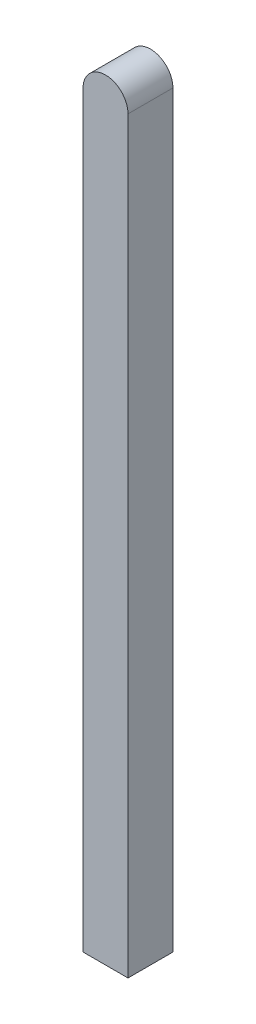
ISO-10303-21;
HEADER;
FILE_DESCRIPTION(('STEP AP214'),'2;1');
FILE_NAME('part.step','',(''),(''),'','','');
FILE_SCHEMA(('AUTOMOTIVE_DESIGN { 1 0 10303 214 1 1 1 1 }'));
ENDSEC;
DATA;
#1=APPLICATION_CONTEXT('core data for automotive mechanical design processes');
#2=APPLICATION_PROTOCOL_DEFINITION('international standard','automotive_design',2000,#1);
#3=PRODUCT_CONTEXT('',#1,'mechanical');
#4=PRODUCT('Part','Part','',(#3));
#5=PRODUCT_RELATED_PRODUCT_CATEGORY('part','',(#4));
#6=PRODUCT_DEFINITION_FORMATION('','',#4);
#7=PRODUCT_DEFINITION_CONTEXT('part definition',#1,'design');
#8=PRODUCT_DEFINITION('design','',#6,#7);
#9=PRODUCT_DEFINITION_SHAPE('','',#8);
#10=(LENGTH_UNIT() NAMED_UNIT(*) SI_UNIT(.MILLI.,.METRE.));
#11=(NAMED_UNIT(*) PLANE_ANGLE_UNIT() SI_UNIT($,.RADIAN.));
#12=(NAMED_UNIT(*) SI_UNIT($,.STERADIAN.) SOLID_ANGLE_UNIT());
#13=UNCERTAINTY_MEASURE_WITH_UNIT(LENGTH_MEASURE(1.E-05),#10,'distance_accuracy_value','');
#14=(GEOMETRIC_REPRESENTATION_CONTEXT(3) GLOBAL_UNCERTAINTY_ASSIGNED_CONTEXT((#13)) GLOBAL_UNIT_ASSIGNED_CONTEXT((#10,
#11,#12)) REPRESENTATION_CONTEXT('',''));
#15=CARTESIAN_POINT('',(0.,0.,0.));
#16=DIRECTION('',(0.,0.,1.));
#17=DIRECTION('',(1.,0.,0.));
#18=AXIS2_PLACEMENT_3D('',#15,#16,#17);
#19=CARTESIAN_POINT('',(15.,500.,-15.));
#20=DIRECTION('',(-1.,0.,0.));
#21=DIRECTION('',(0.,0.,1.));
#22=AXIS2_PLACEMENT_3D('',#19,#20,#21);
#23=PLANE('',#22);
#24=DIRECTION('',(0.,0.,-1.));
#25=VECTOR('',#24,1.);
#26=CARTESIAN_POINT('',(15.,0.,-15.));
#27=LINE('',#26,#25);
#28=CARTESIAN_POINT('',(15.,0.,15.));
#29=VERTEX_POINT('',#28);
#30=CARTESIAN_POINT('',(15.,0.,-15.));
#31=VERTEX_POINT('',#30);
#32=EDGE_CURVE('E101',#29,#31,#27,.T.);
#33=ORIENTED_EDGE('',*,*,#32,.T.);
#34=DIRECTION('',(0.,-1.,0.));
#35=VECTOR('',#34,1.);
#36=CARTESIAN_POINT('',(15.,500.,-15.));
#37=LINE('',#36,#35);
#38=CARTESIAN_POINT('',(15.,500.,-15.));
#39=VERTEX_POINT('',#38);
#40=EDGE_CURVE('E11',#39,#31,#37,.T.);
#41=ORIENTED_EDGE('',*,*,#40,.F.);
#42=DIRECTION('',(0.,0.,-1.));
#43=VECTOR('',#42,1.);
#44=CARTESIAN_POINT('',(15.,500.,-15.));
#45=LINE('',#44,#43);
#46=CARTESIAN_POINT('',(15.,500.,15.));
#47=VERTEX_POINT('',#46);
#48=EDGE_CURVE('E84',#47,#39,#45,.T.);
#49=ORIENTED_EDGE('',*,*,#48,.F.);
#50=DIRECTION('',(0.,-1.,0.));
#51=VECTOR('',#50,1.);
#52=CARTESIAN_POINT('',(15.,500.,15.));
#53=LINE('',#52,#51);
#54=EDGE_CURVE('E85',#47,#29,#53,.T.);
#55=ORIENTED_EDGE('',*,*,#54,.T.);
#56=EDGE_LOOP('',(#33,#41,#49,#55));
#57=FACE_BOUND('',#56,.T.);
#58=ADVANCED_FACE('F39',(#57),#23,.F.);
#59=CARTESIAN_POINT('',(-15.,500.,-15.));
#60=DIRECTION('',(0.,0.,1.));
#61=DIRECTION('',(1.,0.,0.));
#62=AXIS2_PLACEMENT_3D('',#59,#60,#61);
#63=PLANE('',#62);
#64=DIRECTION('',(0.,-1.,0.));
#65=VECTOR('',#64,1.);
#66=CARTESIAN_POINT('',(-15.,500.,-15.));
#67=LINE('',#66,#65);
#68=CARTESIAN_POINT('',(-15.,500.,-15.));
#69=VERTEX_POINT('',#68);
#70=CARTESIAN_POINT('',(-15.,0.,-15.));
#71=VERTEX_POINT('',#70);
#72=EDGE_CURVE('E47',#69,#71,#67,.T.);
#73=ORIENTED_EDGE('',*,*,#72,.F.);
#74=CARTESIAN_POINT('',(0.,500.,-15.));
#75=DIRECTION('',(0.,0.,1.));
#76=DIRECTION('',(1.,0.,0.));
#77=AXIS2_PLACEMENT_3D('',#74,#75,#76);
#78=CIRCLE('',#77,15.);
#79=EDGE_CURVE('E98',#39,#69,#78,.T.);
#80=ORIENTED_EDGE('',*,*,#79,.F.);
#81=ORIENTED_EDGE('',*,*,#40,.T.);
#82=DIRECTION('',(-1.,0.,0.));
#83=VECTOR('',#82,1.);
#84=CARTESIAN_POINT('',(-15.,0.,-15.));
#85=LINE('',#84,#83);
#86=EDGE_CURVE('E110',#31,#71,#85,.T.);
#87=ORIENTED_EDGE('',*,*,#86,.T.);
#88=EDGE_LOOP('',(#73,#80,#81,#87));
#89=FACE_BOUND('',#88,.T.);
#90=ADVANCED_FACE('F118',(#89),#63,.F.);
#91=CARTESIAN_POINT('',(-15.,500.,-15.));
#92=DIRECTION('',(1.,0.,0.));
#93=DIRECTION('',(0.,0.,-1.));
#94=AXIS2_PLACEMENT_3D('',#91,#92,#93);
#95=PLANE('',#94);
#96=DIRECTION('',(0.,0.,1.));
#97=VECTOR('',#96,1.);
#98=CARTESIAN_POINT('',(-15.,0.,-15.));
#99=LINE('',#98,#97);
#100=CARTESIAN_POINT('',(-15.,0.,15.));
#101=VERTEX_POINT('',#100);
#102=EDGE_CURVE('E71',#71,#101,#99,.T.);
#103=ORIENTED_EDGE('',*,*,#102,.T.);
#104=DIRECTION('',(0.,-1.,0.));
#105=VECTOR('',#104,1.);
#106=CARTESIAN_POINT('',(-15.,500.,15.));
#107=LINE('',#106,#105);
#108=CARTESIAN_POINT('',(-15.,500.,15.));
#109=VERTEX_POINT('',#108);
#110=EDGE_CURVE('E55',#109,#101,#107,.T.);
#111=ORIENTED_EDGE('',*,*,#110,.F.);
#112=DIRECTION('',(0.,0.,1.));
#113=VECTOR('',#112,1.);
#114=CARTESIAN_POINT('',(-15.,500.,-15.));
#115=LINE('',#114,#113);
#116=EDGE_CURVE('E91',#69,#109,#115,.T.);
#117=ORIENTED_EDGE('',*,*,#116,.F.);
#118=ORIENTED_EDGE('',*,*,#72,.T.);
#119=EDGE_LOOP('',(#103,#111,#117,#118));
#120=FACE_BOUND('',#119,.T.);
#121=ADVANCED_FACE('F114',(#120),#95,.F.);
#122=CARTESIAN_POINT('',(-15.,500.,15.));
#123=DIRECTION('',(0.,0.,-1.));
#124=DIRECTION('',(-1.,0.,0.));
#125=AXIS2_PLACEMENT_3D('',#122,#123,#124);
#126=PLANE('',#125);
#127=ORIENTED_EDGE('',*,*,#54,.F.);
#128=CARTESIAN_POINT('',(0.,500.,15.));
#129=DIRECTION('',(0.,0.,1.));
#130=DIRECTION('',(1.,0.,0.));
#131=AXIS2_PLACEMENT_3D('',#128,#129,#130);
#132=CIRCLE('',#131,15.);
#133=EDGE_CURVE('E95',#47,#109,#132,.T.);
#134=ORIENTED_EDGE('',*,*,#133,.T.);
#135=ORIENTED_EDGE('',*,*,#110,.T.);
#136=DIRECTION('',(1.,0.,0.));
#137=VECTOR('',#136,1.);
#138=CARTESIAN_POINT('',(-15.,0.,15.));
#139=LINE('',#138,#137);
#140=EDGE_CURVE('E76',#101,#29,#139,.T.);
#141=ORIENTED_EDGE('',*,*,#140,.T.);
#142=EDGE_LOOP('',(#127,#134,#135,#141));
#143=FACE_BOUND('',#142,.T.);
#144=ADVANCED_FACE('F94',(#143),#126,.F.);
#145=CARTESIAN_POINT('',(0.,0.,0.));
#146=DIRECTION('',(0.,1.,0.));
#147=DIRECTION('',(0.,0.,1.));
#148=AXIS2_PLACEMENT_3D('',#145,#146,#147);
#149=PLANE('',#148);
#150=CARTESIAN_POINT('',(0.,0.,0.));
#151=DIRECTION('',(0.,-1.,0.));
#152=DIRECTION('',(0.,0.,-1.));
#153=AXIS2_PLACEMENT_3D('',#150,#151,#152);
#154=CIRCLE('',#153,10.);
#155=CARTESIAN_POINT('',(0.,0.,-10.));
#156=VERTEX_POINT('',#155);
#157=EDGE_CURVE('E104',#156,#156,#154,.T.);
#158=ORIENTED_EDGE('',*,*,#157,.F.);
#159=EDGE_LOOP('',(#158));
#160=FACE_BOUND('',#159,.T.);
#161=ORIENTED_EDGE('',*,*,#32,.F.);
#162=ORIENTED_EDGE('',*,*,#140,.F.);
#163=ORIENTED_EDGE('',*,*,#102,.F.);
#164=ORIENTED_EDGE('',*,*,#86,.F.);
#165=EDGE_LOOP('',(#161,#162,#163,#164));
#166=FACE_BOUND('',#165,.T.);
#167=ADVANCED_FACE('F117',(#160,#166),#149,.F.);
#168=CARTESIAN_POINT('',(0.,500.,-15.));
#169=DIRECTION('',(0.,0.,1.));
#170=DIRECTION('',(1.,0.,0.));
#171=AXIS2_PLACEMENT_3D('',#168,#169,#170);
#172=CYLINDRICAL_SURFACE('',#171,15.);
#173=ORIENTED_EDGE('',*,*,#79,.T.);
#174=ORIENTED_EDGE('',*,*,#116,.T.);
#175=ORIENTED_EDGE('',*,*,#133,.F.);
#176=ORIENTED_EDGE('',*,*,#48,.T.);
#177=EDGE_LOOP('',(#173,#174,#175,#176));
#178=FACE_BOUND('',#177,.T.);
#179=ADVANCED_FACE('F97',(#178),#172,.T.);
#180=CARTESIAN_POINT('',(0.,50.,0.));
#181=DIRECTION('',(0.,-1.,0.));
#182=DIRECTION('',(0.,0.,-1.));
#183=AXIS2_PLACEMENT_3D('',#180,#181,#182);
#184=CYLINDRICAL_SURFACE('',#183,10.);
#185=CARTESIAN_POINT('',(0.,50.,0.));
#186=DIRECTION('',(0.,-1.,0.));
#187=DIRECTION('',(0.,0.,-1.));
#188=AXIS2_PLACEMENT_3D('',#185,#186,#187);
#189=CIRCLE('',#188,10.);
#190=CARTESIAN_POINT('',(0.,50.,-10.));
#191=VERTEX_POINT('',#190);
#192=EDGE_CURVE('E99',#191,#191,#189,.T.);
#193=ORIENTED_EDGE('',*,*,#192,.F.);
#194=EDGE_LOOP('',(#193));
#195=FACE_BOUND('',#194,.T.);
#196=ORIENTED_EDGE('',*,*,#157,.T.);
#197=EDGE_LOOP('',(#196));
#198=FACE_BOUND('',#197,.T.);
#199=ADVANCED_FACE('F133',(#195,#198),#184,.F.);
#200=CARTESIAN_POINT('',(0.,50.,0.));
#201=DIRECTION('',(0.,-1.,0.));
#202=DIRECTION('',(0.,0.,-1.));
#203=AXIS2_PLACEMENT_3D('',#200,#201,#202);
#204=PLANE('',#203);
#205=ORIENTED_EDGE('',*,*,#192,.T.);
#206=EDGE_LOOP('',(#205));
#207=FACE_BOUND('',#206,.T.);
#208=ADVANCED_FACE('F136',(#207),#204,.T.);
#209=CLOSED_SHELL('',(#58,#90,#121,#144,#167,#179,#199,#208));
#210=MANIFOLD_SOLID_BREP('B2',#209);
#211=ADVANCED_BREP_SHAPE_REPRESENTATION('',(#18,#210),#14);
#212=SHAPE_DEFINITION_REPRESENTATION(#9,#211);
ENDSEC;
END-ISO-10303-21;
